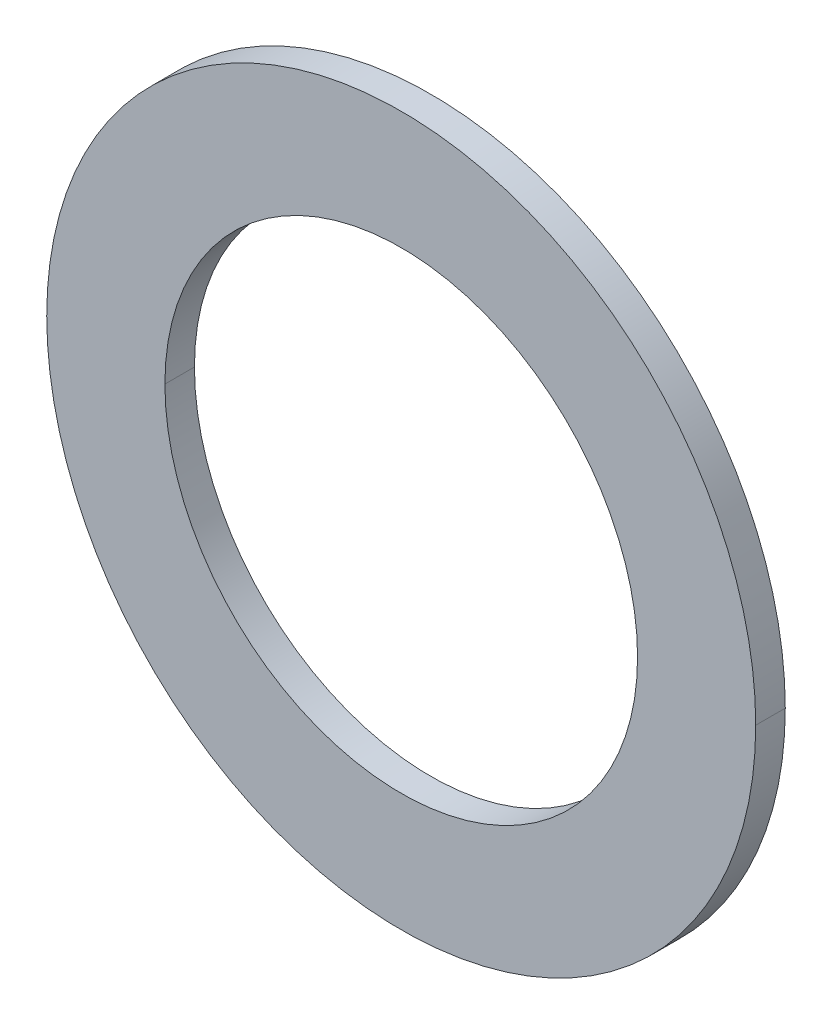
ISO-10303-21;
HEADER;
FILE_DESCRIPTION(('STEP AP214'),'2;1');
FILE_NAME('part.step','',(''),(''),'','','');
FILE_SCHEMA(('AUTOMOTIVE_DESIGN { 1 0 10303 214 1 1 1 1 }'));
ENDSEC;
DATA;
#1=APPLICATION_CONTEXT('core data for automotive mechanical design processes');
#2=APPLICATION_PROTOCOL_DEFINITION('international standard','automotive_design',2000,#1);
#3=PRODUCT_CONTEXT('',#1,'mechanical');
#4=PRODUCT('Part','Part','',(#3));
#5=PRODUCT_RELATED_PRODUCT_CATEGORY('part','',(#4));
#6=PRODUCT_DEFINITION_FORMATION('','',#4);
#7=PRODUCT_DEFINITION_CONTEXT('part definition',#1,'design');
#8=PRODUCT_DEFINITION('design','',#6,#7);
#9=PRODUCT_DEFINITION_SHAPE('','',#8);
#10=(LENGTH_UNIT() NAMED_UNIT(*) SI_UNIT(.MILLI.,.METRE.));
#11=(NAMED_UNIT(*) PLANE_ANGLE_UNIT() SI_UNIT($,.RADIAN.));
#12=(NAMED_UNIT(*) SI_UNIT($,.STERADIAN.) SOLID_ANGLE_UNIT());
#13=UNCERTAINTY_MEASURE_WITH_UNIT(LENGTH_MEASURE(1.E-05),#10,'distance_accuracy_value','');
#14=(GEOMETRIC_REPRESENTATION_CONTEXT(3) GLOBAL_UNCERTAINTY_ASSIGNED_CONTEXT((#13)) GLOBAL_UNIT_ASSIGNED_CONTEXT((#10,
#11,#12)) REPRESENTATION_CONTEXT('',''));
#15=CARTESIAN_POINT('',(0.,0.,0.));
#16=DIRECTION('',(0.,0.,1.));
#17=DIRECTION('',(1.,0.,0.));
#18=AXIS2_PLACEMENT_3D('',#15,#16,#17);
#19=CARTESIAN_POINT('',(0.,0.,0.25));
#20=DIRECTION('',(0.,0.,-1.));
#21=DIRECTION('',(-1.,0.,0.));
#22=AXIS2_PLACEMENT_3D('',#19,#20,#21);
#23=CYLINDRICAL_SURFACE('',#22,2.);
#24=DIRECTION('',(0.,0.,-1.));
#25=VECTOR('',#24,1.);
#26=CARTESIAN_POINT('',(2.,0.,0.25));
#27=LINE('',#26,#25);
#28=CARTESIAN_POINT('',(2.,0.,0.25));
#29=VERTEX_POINT('',#28);
#30=CARTESIAN_POINT('',(2.,0.,0.));
#31=VERTEX_POINT('',#30);
#32=EDGE_CURVE('E94',#29,#31,#27,.T.);
#33=ORIENTED_EDGE('',*,*,#32,.F.);
#34=CARTESIAN_POINT('',(0.,0.,0.25));
#35=DIRECTION('',(0.,0.,1.));
#36=DIRECTION('',(1.,0.,0.));
#37=AXIS2_PLACEMENT_3D('',#34,#35,#36);
#38=CIRCLE('',#37,2.);
#39=CARTESIAN_POINT('',(-2.,0.,0.25));
#40=VERTEX_POINT('',#39);
#41=EDGE_CURVE('E84',#29,#40,#38,.T.);
#42=ORIENTED_EDGE('',*,*,#41,.T.);
#43=DIRECTION('',(0.,0.,-1.));
#44=VECTOR('',#43,1.);
#45=CARTESIAN_POINT('',(-2.,0.,0.25));
#46=LINE('',#45,#44);
#47=CARTESIAN_POINT('',(-2.,0.,0.));
#48=VERTEX_POINT('',#47);
#49=EDGE_CURVE('E99',#40,#48,#46,.T.);
#50=ORIENTED_EDGE('',*,*,#49,.T.);
#51=CARTESIAN_POINT('',(0.,0.,0.));
#52=DIRECTION('',(0.,0.,1.));
#53=DIRECTION('',(1.,0.,0.));
#54=AXIS2_PLACEMENT_3D('',#51,#52,#53);
#55=CIRCLE('',#54,2.);
#56=EDGE_CURVE('E11',#31,#48,#55,.T.);
#57=ORIENTED_EDGE('',*,*,#56,.F.);
#58=EDGE_LOOP('',(#33,#42,#50,#57));
#59=FACE_BOUND('',#58,.T.);
#60=ADVANCED_FACE('F17',(#59),#23,.F.);
#61=CARTESIAN_POINT('',(0.,0.,0.25));
#62=DIRECTION('',(0.,0.,-1.));
#63=DIRECTION('',(-1.,0.,0.));
#64=AXIS2_PLACEMENT_3D('',#61,#62,#63);
#65=CYLINDRICAL_SURFACE('',#64,3.);
#66=DIRECTION('',(0.,0.,-1.));
#67=VECTOR('',#66,1.);
#68=CARTESIAN_POINT('',(3.,0.,0.25));
#69=LINE('',#68,#67);
#70=CARTESIAN_POINT('',(3.,0.,0.25));
#71=VERTEX_POINT('',#70);
#72=CARTESIAN_POINT('',(3.,0.,0.));
#73=VERTEX_POINT('',#72);
#74=EDGE_CURVE('E107',#71,#73,#69,.T.);
#75=ORIENTED_EDGE('',*,*,#74,.F.);
#76=CARTESIAN_POINT('',(0.,0.,0.25));
#77=DIRECTION('',(0.,0.,1.));
#78=DIRECTION('',(1.,0.,0.));
#79=AXIS2_PLACEMENT_3D('',#76,#77,#78);
#80=CIRCLE('',#79,3.);
#81=CARTESIAN_POINT('',(-3.,0.,0.25));
#82=VERTEX_POINT('',#81);
#83=EDGE_CURVE('E63',#82,#71,#80,.T.);
#84=ORIENTED_EDGE('',*,*,#83,.F.);
#85=DIRECTION('',(0.,0.,-1.));
#86=VECTOR('',#85,1.);
#87=CARTESIAN_POINT('',(-3.,0.,0.25));
#88=LINE('',#87,#86);
#89=CARTESIAN_POINT('',(-3.,0.,0.));
#90=VERTEX_POINT('',#89);
#91=EDGE_CURVE('E115',#82,#90,#88,.T.);
#92=ORIENTED_EDGE('',*,*,#91,.T.);
#93=CARTESIAN_POINT('',(0.,0.,0.));
#94=DIRECTION('',(0.,0.,1.));
#95=DIRECTION('',(1.,0.,0.));
#96=AXIS2_PLACEMENT_3D('',#93,#94,#95);
#97=CIRCLE('',#96,3.);
#98=EDGE_CURVE('E28',#90,#73,#97,.T.);
#99=ORIENTED_EDGE('',*,*,#98,.T.);
#100=EDGE_LOOP('',(#75,#84,#92,#99));
#101=FACE_BOUND('',#100,.T.);
#102=ADVANCED_FACE('F130',(#101),#65,.T.);
#103=CARTESIAN_POINT('',(0.,0.,0.));
#104=DIRECTION('',(0.,0.,1.));
#105=DIRECTION('',(1.,0.,0.));
#106=AXIS2_PLACEMENT_3D('',#103,#104,#105);
#107=PLANE('',#106);
#108=CARTESIAN_POINT('',(0.,0.,0.));
#109=DIRECTION('',(0.,0.,1.));
#110=DIRECTION('',(1.,0.,0.));
#111=AXIS2_PLACEMENT_3D('',#108,#109,#110);
#112=CIRCLE('',#111,2.);
#113=EDGE_CURVE('E21',#48,#31,#112,.T.);
#114=ORIENTED_EDGE('',*,*,#113,.T.);
#115=ORIENTED_EDGE('',*,*,#56,.T.);
#116=EDGE_LOOP('',(#114,#115));
#117=FACE_BOUND('',#116,.T.);
#118=ORIENTED_EDGE('',*,*,#98,.F.);
#119=CARTESIAN_POINT('',(0.,0.,0.));
#120=DIRECTION('',(0.,0.,1.));
#121=DIRECTION('',(1.,0.,0.));
#122=AXIS2_PLACEMENT_3D('',#119,#120,#121);
#123=CIRCLE('',#122,3.);
#124=EDGE_CURVE('E111',#73,#90,#123,.T.);
#125=ORIENTED_EDGE('',*,*,#124,.F.);
#126=EDGE_LOOP('',(#118,#125));
#127=FACE_BOUND('',#126,.T.);
#128=ADVANCED_FACE('F128',(#117,#127),#107,.F.);
#129=CARTESIAN_POINT('',(0.,0.,0.25));
#130=DIRECTION('',(0.,0.,1.));
#131=DIRECTION('',(1.,0.,0.));
#132=AXIS2_PLACEMENT_3D('',#129,#130,#131);
#133=PLANE('',#132);
#134=CARTESIAN_POINT('',(0.,0.,0.25));
#135=DIRECTION('',(0.,0.,1.));
#136=DIRECTION('',(1.,0.,0.));
#137=AXIS2_PLACEMENT_3D('',#134,#135,#136);
#138=CIRCLE('',#137,2.);
#139=EDGE_CURVE('E88',#40,#29,#138,.T.);
#140=ORIENTED_EDGE('',*,*,#139,.F.);
#141=ORIENTED_EDGE('',*,*,#41,.F.);
#142=EDGE_LOOP('',(#140,#141));
#143=FACE_BOUND('',#142,.T.);
#144=ORIENTED_EDGE('',*,*,#83,.T.);
#145=CARTESIAN_POINT('',(0.,0.,0.25));
#146=DIRECTION('',(0.,0.,1.));
#147=DIRECTION('',(1.,0.,0.));
#148=AXIS2_PLACEMENT_3D('',#145,#146,#147);
#149=CIRCLE('',#148,3.);
#150=EDGE_CURVE('E112',#71,#82,#149,.T.);
#151=ORIENTED_EDGE('',*,*,#150,.T.);
#152=EDGE_LOOP('',(#144,#151));
#153=FACE_BOUND('',#152,.T.);
#154=ADVANCED_FACE('F86',(#143,#153),#133,.T.);
#155=CARTESIAN_POINT('',(0.,0.,0.25));
#156=DIRECTION('',(0.,0.,-1.));
#157=DIRECTION('',(-1.,0.,0.));
#158=AXIS2_PLACEMENT_3D('',#155,#156,#157);
#159=CYLINDRICAL_SURFACE('',#158,3.);
#160=ORIENTED_EDGE('',*,*,#150,.F.);
#161=ORIENTED_EDGE('',*,*,#74,.T.);
#162=ORIENTED_EDGE('',*,*,#124,.T.);
#163=ORIENTED_EDGE('',*,*,#91,.F.);
#164=EDGE_LOOP('',(#160,#161,#162,#163));
#165=FACE_BOUND('',#164,.T.);
#166=ADVANCED_FACE('F127',(#165),#159,.T.);
#167=CARTESIAN_POINT('',(0.,0.,0.25));
#168=DIRECTION('',(0.,0.,-1.));
#169=DIRECTION('',(-1.,0.,0.));
#170=AXIS2_PLACEMENT_3D('',#167,#168,#169);
#171=CYLINDRICAL_SURFACE('',#170,2.);
#172=ORIENTED_EDGE('',*,*,#139,.T.);
#173=ORIENTED_EDGE('',*,*,#32,.T.);
#174=ORIENTED_EDGE('',*,*,#113,.F.);
#175=ORIENTED_EDGE('',*,*,#49,.F.);
#176=EDGE_LOOP('',(#172,#173,#174,#175));
#177=FACE_BOUND('',#176,.T.);
#178=ADVANCED_FACE('F19',(#177),#171,.F.);
#179=CLOSED_SHELL('',(#60,#102,#128,#154,#166,#178));
#180=MANIFOLD_SOLID_BREP('B1',#179);
#181=ADVANCED_BREP_SHAPE_REPRESENTATION('',(#18,#180),#14);
#182=SHAPE_DEFINITION_REPRESENTATION(#9,#181);
ENDSEC;
END-ISO-10303-21;
